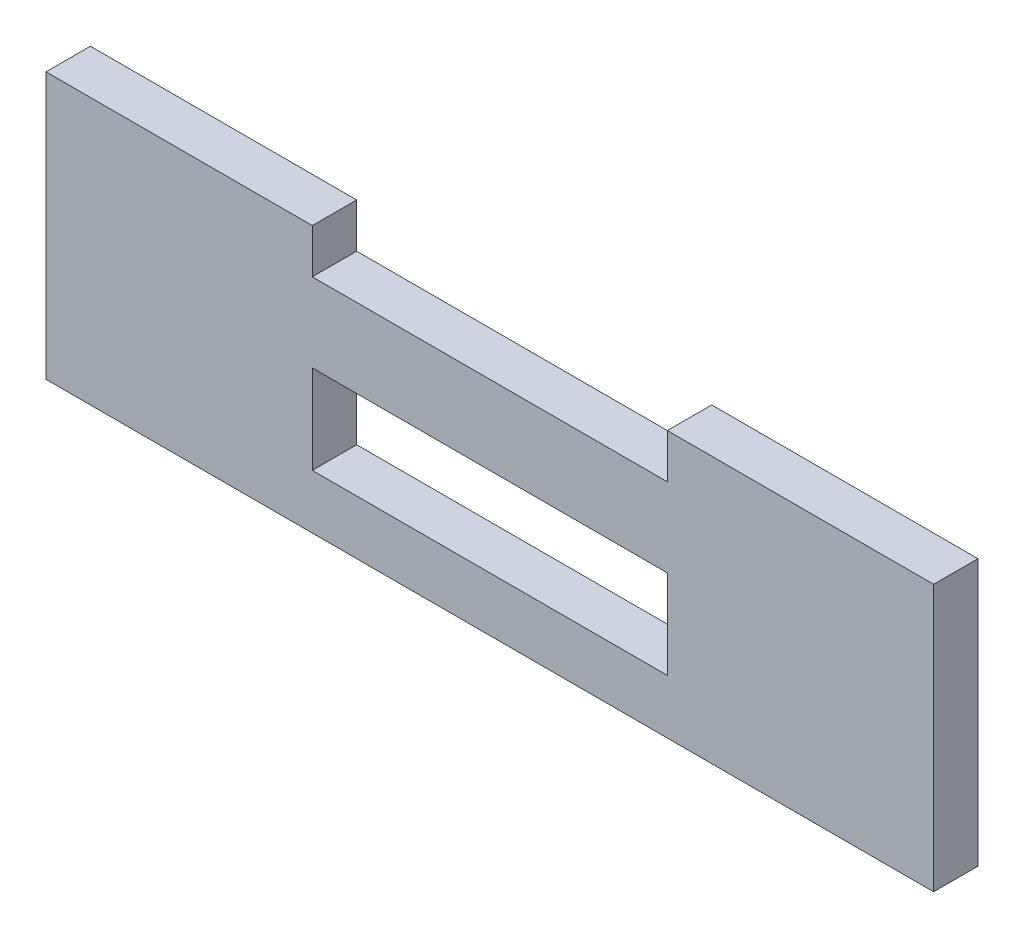
ISO-10303-21;
HEADER;
FILE_DESCRIPTION(('STEP AP214'),'2;1');
FILE_NAME('part.step','',(''),(''),'','','');
FILE_SCHEMA(('AUTOMOTIVE_DESIGN { 1 0 10303 214 1 1 1 1 }'));
ENDSEC;
DATA;
#1=APPLICATION_CONTEXT('core data for automotive mechanical design processes');
#2=APPLICATION_PROTOCOL_DEFINITION('international standard','automotive_design',2000,#1);
#3=PRODUCT_CONTEXT('',#1,'mechanical');
#4=PRODUCT('Part','Part','',(#3));
#5=PRODUCT_RELATED_PRODUCT_CATEGORY('part','',(#4));
#6=PRODUCT_DEFINITION_FORMATION('','',#4);
#7=PRODUCT_DEFINITION_CONTEXT('part definition',#1,'design');
#8=PRODUCT_DEFINITION('design','',#6,#7);
#9=PRODUCT_DEFINITION_SHAPE('','',#8);
#10=(LENGTH_UNIT() NAMED_UNIT(*) SI_UNIT(.MILLI.,.METRE.));
#11=(NAMED_UNIT(*) PLANE_ANGLE_UNIT() SI_UNIT($,.RADIAN.));
#12=(NAMED_UNIT(*) SI_UNIT($,.STERADIAN.) SOLID_ANGLE_UNIT());
#13=UNCERTAINTY_MEASURE_WITH_UNIT(LENGTH_MEASURE(1.E-05),#10,'distance_accuracy_value','');
#14=(GEOMETRIC_REPRESENTATION_CONTEXT(3) GLOBAL_UNCERTAINTY_ASSIGNED_CONTEXT((#13)) GLOBAL_UNIT_ASSIGNED_CONTEXT((#10,
#11,#12)) REPRESENTATION_CONTEXT('',''));
#15=CARTESIAN_POINT('',(0.,0.,0.));
#16=DIRECTION('',(0.,0.,1.));
#17=DIRECTION('',(1.,0.,0.));
#18=AXIS2_PLACEMENT_3D('',#15,#16,#17);
#19=CARTESIAN_POINT('',(20.,3.88549677867985,5.));
#20=DIRECTION('',(0.,-1.,0.));
#21=DIRECTION('',(1.,0.,0.));
#22=AXIS2_PLACEMENT_3D('',#19,#20,#21);
#23=PLANE('',#22);
#24=DIRECTION('',(-1.,0.,0.));
#25=VECTOR('',#24,1.);
#26=CARTESIAN_POINT('',(20.,3.88549677867985,0.));
#27=LINE('',#26,#25);
#28=CARTESIAN_POINT('',(50.,3.88549677867985,0.));
#29=VERTEX_POINT('',#28);
#30=CARTESIAN_POINT('',(20.,3.88549677867985,0.));
#31=VERTEX_POINT('',#30);
#32=EDGE_CURVE('E154',#29,#31,#27,.T.);
#33=ORIENTED_EDGE('',*,*,#32,.T.);
#34=DIRECTION('',(0.,0.,-1.));
#35=VECTOR('',#34,1.);
#36=CARTESIAN_POINT('',(20.,3.88549677867985,5.));
#37=LINE('',#36,#35);
#38=CARTESIAN_POINT('',(20.,3.88549677867985,5.));
#39=VERTEX_POINT('',#38);
#40=EDGE_CURVE('E11',#39,#31,#37,.T.);
#41=ORIENTED_EDGE('',*,*,#40,.F.);
#42=DIRECTION('',(-1.,0.,0.));
#43=VECTOR('',#42,1.);
#44=CARTESIAN_POINT('',(20.,3.88549677867985,5.));
#45=LINE('',#44,#43);
#46=CARTESIAN_POINT('',(50.,3.88549677867985,5.));
#47=VERTEX_POINT('',#46);
#48=EDGE_CURVE('E158',#47,#39,#45,.T.);
#49=ORIENTED_EDGE('',*,*,#48,.F.);
#50=DIRECTION('',(0.,0.,-1.));
#51=VECTOR('',#50,1.);
#52=CARTESIAN_POINT('',(50.,3.88549677867985,5.));
#53=LINE('',#52,#51);
#54=EDGE_CURVE('E176',#47,#29,#53,.T.);
#55=ORIENTED_EDGE('',*,*,#54,.T.);
#56=EDGE_LOOP('',(#33,#41,#49,#55));
#57=FACE_BOUND('',#56,.T.);
#58=ADVANCED_FACE('F33',(#57),#23,.F.);
#59=CARTESIAN_POINT('',(20.,-1.11450322132015,5.));
#60=DIRECTION('',(1.,0.,0.));
#61=DIRECTION('',(0.,0.,-1.));
#62=AXIS2_PLACEMENT_3D('',#59,#60,#61);
#63=PLANE('',#62);
#64=DIRECTION('',(0.,-1.,0.));
#65=VECTOR('',#64,1.);
#66=CARTESIAN_POINT('',(20.,-1.11450322132015,0.));
#67=LINE('',#66,#65);
#68=CARTESIAN_POINT('',(20.,-1.11450322132015,0.));
#69=VERTEX_POINT('',#68);
#70=EDGE_CURVE('E179',#31,#69,#67,.T.);
#71=ORIENTED_EDGE('',*,*,#70,.T.);
#72=DIRECTION('',(0.,0.,-1.));
#73=VECTOR('',#72,1.);
#74=CARTESIAN_POINT('',(20.,-1.11450322132015,5.));
#75=LINE('',#74,#73);
#76=CARTESIAN_POINT('',(20.,-1.11450322132015,5.));
#77=VERTEX_POINT('',#76);
#78=EDGE_CURVE('E40',#77,#69,#75,.T.);
#79=ORIENTED_EDGE('',*,*,#78,.F.);
#80=DIRECTION('',(0.,-1.,0.));
#81=VECTOR('',#80,1.);
#82=CARTESIAN_POINT('',(20.,-1.11450322132015,5.));
#83=LINE('',#82,#81);
#84=EDGE_CURVE('E161',#39,#77,#83,.T.);
#85=ORIENTED_EDGE('',*,*,#84,.F.);
#86=ORIENTED_EDGE('',*,*,#40,.T.);
#87=EDGE_LOOP('',(#71,#79,#85,#86));
#88=FACE_BOUND('',#87,.T.);
#89=ADVANCED_FACE('F234',(#88),#63,.F.);
#90=CARTESIAN_POINT('',(-20.,-1.11450322132015,5.));
#91=DIRECTION('',(0.,-1.,0.));
#92=DIRECTION('',(0.,0.,-1.));
#93=AXIS2_PLACEMENT_3D('',#90,#91,#92);
#94=PLANE('',#93);
#95=DIRECTION('',(-1.,0.,0.));
#96=VECTOR('',#95,1.);
#97=CARTESIAN_POINT('',(-20.,-1.11450322132015,0.));
#98=LINE('',#97,#96);
#99=CARTESIAN_POINT('',(-20.,-1.11450322132015,0.));
#100=VERTEX_POINT('',#99);
#101=EDGE_CURVE('E181',#69,#100,#98,.T.);
#102=ORIENTED_EDGE('',*,*,#101,.T.);
#103=DIRECTION('',(0.,0.,-1.));
#104=VECTOR('',#103,1.);
#105=CARTESIAN_POINT('',(-20.,-1.11450322132015,5.));
#106=LINE('',#105,#104);
#107=CARTESIAN_POINT('',(-20.,-1.11450322132015,5.));
#108=VERTEX_POINT('',#107);
#109=EDGE_CURVE('E206',#108,#100,#106,.T.);
#110=ORIENTED_EDGE('',*,*,#109,.F.);
#111=DIRECTION('',(-1.,0.,0.));
#112=VECTOR('',#111,1.);
#113=CARTESIAN_POINT('',(-20.,-1.11450322132015,5.));
#114=LINE('',#113,#112);
#115=EDGE_CURVE('E164',#77,#108,#114,.T.);
#116=ORIENTED_EDGE('',*,*,#115,.F.);
#117=ORIENTED_EDGE('',*,*,#78,.T.);
#118=EDGE_LOOP('',(#102,#110,#116,#117));
#119=FACE_BOUND('',#118,.T.);
#120=ADVANCED_FACE('F213',(#119),#94,.F.);
#121=CARTESIAN_POINT('',(-20.,3.88549677867985,5.));
#122=DIRECTION('',(-1.,0.,0.));
#123=DIRECTION('',(0.,0.,1.));
#124=AXIS2_PLACEMENT_3D('',#121,#122,#123);
#125=PLANE('',#124);
#126=DIRECTION('',(0.,1.,0.));
#127=VECTOR('',#126,1.);
#128=CARTESIAN_POINT('',(-20.,3.88549677867985,0.));
#129=LINE('',#128,#127);
#130=CARTESIAN_POINT('',(-20.,3.88549677867985,0.));
#131=VERTEX_POINT('',#130);
#132=EDGE_CURVE('E183',#100,#131,#129,.T.);
#133=ORIENTED_EDGE('',*,*,#132,.T.);
#134=DIRECTION('',(0.,0.,-1.));
#135=VECTOR('',#134,1.);
#136=CARTESIAN_POINT('',(-20.,3.88549677867985,5.));
#137=LINE('',#136,#135);
#138=CARTESIAN_POINT('',(-20.,3.88549677867985,5.));
#139=VERTEX_POINT('',#138);
#140=EDGE_CURVE('E203',#139,#131,#137,.T.);
#141=ORIENTED_EDGE('',*,*,#140,.F.);
#142=DIRECTION('',(0.,1.,0.));
#143=VECTOR('',#142,1.);
#144=CARTESIAN_POINT('',(-20.,3.88549677867985,5.));
#145=LINE('',#144,#143);
#146=EDGE_CURVE('E166',#108,#139,#145,.T.);
#147=ORIENTED_EDGE('',*,*,#146,.F.);
#148=ORIENTED_EDGE('',*,*,#109,.T.);
#149=EDGE_LOOP('',(#133,#141,#147,#148));
#150=FACE_BOUND('',#149,.T.);
#151=ADVANCED_FACE('F222',(#150),#125,.F.);
#152=CARTESIAN_POINT('',(-50.,3.88549677867985,5.));
#153=DIRECTION('',(0.,-1.,0.));
#154=DIRECTION('',(1.,0.,0.));
#155=AXIS2_PLACEMENT_3D('',#152,#153,#154);
#156=PLANE('',#155);
#157=DIRECTION('',(-1.,0.,0.));
#158=VECTOR('',#157,1.);
#159=CARTESIAN_POINT('',(-50.,3.88549677867985,0.));
#160=LINE('',#159,#158);
#161=CARTESIAN_POINT('',(-50.,3.88549677867985,0.));
#162=VERTEX_POINT('',#161);
#163=EDGE_CURVE('E185',#131,#162,#160,.T.);
#164=ORIENTED_EDGE('',*,*,#163,.T.);
#165=DIRECTION('',(0.,0.,-1.));
#166=VECTOR('',#165,1.);
#167=CARTESIAN_POINT('',(-50.,3.88549677867985,5.));
#168=LINE('',#167,#166);
#169=CARTESIAN_POINT('',(-50.,3.88549677867985,5.));
#170=VERTEX_POINT('',#169);
#171=EDGE_CURVE('E200',#170,#162,#168,.T.);
#172=ORIENTED_EDGE('',*,*,#171,.F.);
#173=DIRECTION('',(-1.,0.,0.));
#174=VECTOR('',#173,1.);
#175=CARTESIAN_POINT('',(-50.,3.88549677867985,5.));
#176=LINE('',#175,#174);
#177=EDGE_CURVE('E168',#139,#170,#176,.T.);
#178=ORIENTED_EDGE('',*,*,#177,.F.);
#179=ORIENTED_EDGE('',*,*,#140,.T.);
#180=EDGE_LOOP('',(#164,#172,#178,#179));
#181=FACE_BOUND('',#180,.T.);
#182=ADVANCED_FACE('F226',(#181),#156,.F.);
#183=CARTESIAN_POINT('',(-50.,-26.1145032213201,5.));
#184=DIRECTION('',(1.,0.,0.));
#185=DIRECTION('',(0.,0.,-1.));
#186=AXIS2_PLACEMENT_3D('',#183,#184,#185);
#187=PLANE('',#186);
#188=DIRECTION('',(0.,-1.,0.));
#189=VECTOR('',#188,1.);
#190=CARTESIAN_POINT('',(-50.,-26.1145032213201,0.));
#191=LINE('',#190,#189);
#192=CARTESIAN_POINT('',(-50.,-26.1145032213201,0.));
#193=VERTEX_POINT('',#192);
#194=EDGE_CURVE('E187',#162,#193,#191,.T.);
#195=ORIENTED_EDGE('',*,*,#194,.T.);
#196=DIRECTION('',(0.,0.,-1.));
#197=VECTOR('',#196,1.);
#198=CARTESIAN_POINT('',(-50.,-26.1145032213201,5.));
#199=LINE('',#198,#197);
#200=CARTESIAN_POINT('',(-50.,-26.1145032213201,5.));
#201=VERTEX_POINT('',#200);
#202=EDGE_CURVE('E197',#201,#193,#199,.T.);
#203=ORIENTED_EDGE('',*,*,#202,.F.);
#204=DIRECTION('',(0.,-1.,0.));
#205=VECTOR('',#204,1.);
#206=CARTESIAN_POINT('',(-50.,-26.1145032213201,5.));
#207=LINE('',#206,#205);
#208=EDGE_CURVE('E170',#170,#201,#207,.T.);
#209=ORIENTED_EDGE('',*,*,#208,.F.);
#210=ORIENTED_EDGE('',*,*,#171,.T.);
#211=EDGE_LOOP('',(#195,#203,#209,#210));
#212=FACE_BOUND('',#211,.T.);
#213=ADVANCED_FACE('F247',(#212),#187,.F.);
#214=CARTESIAN_POINT('',(-50.,-26.1145032213201,5.));
#215=DIRECTION('',(0.,1.,0.));
#216=DIRECTION('',(0.,0.,1.));
#217=AXIS2_PLACEMENT_3D('',#214,#215,#216);
#218=PLANE('',#217);
#219=DIRECTION('',(1.,0.,0.));
#220=VECTOR('',#219,1.);
#221=CARTESIAN_POINT('',(-50.,-26.1145032213201,0.));
#222=LINE('',#221,#220);
#223=CARTESIAN_POINT('',(50.,-26.1145032213201,0.));
#224=VERTEX_POINT('',#223);
#225=EDGE_CURVE('E189',#193,#224,#222,.T.);
#226=ORIENTED_EDGE('',*,*,#225,.T.);
#227=DIRECTION('',(0.,0.,-1.));
#228=VECTOR('',#227,1.);
#229=CARTESIAN_POINT('',(50.,-26.1145032213201,5.));
#230=LINE('',#229,#228);
#231=CARTESIAN_POINT('',(50.,-26.1145032213201,5.));
#232=VERTEX_POINT('',#231);
#233=EDGE_CURVE('E194',#232,#224,#230,.T.);
#234=ORIENTED_EDGE('',*,*,#233,.F.);
#235=DIRECTION('',(1.,0.,0.));
#236=VECTOR('',#235,1.);
#237=CARTESIAN_POINT('',(-50.,-26.1145032213201,5.));
#238=LINE('',#237,#236);
#239=EDGE_CURVE('E172',#201,#232,#238,.T.);
#240=ORIENTED_EDGE('',*,*,#239,.F.);
#241=ORIENTED_EDGE('',*,*,#202,.T.);
#242=EDGE_LOOP('',(#226,#234,#240,#241));
#243=FACE_BOUND('',#242,.T.);
#244=ADVANCED_FACE('F245',(#243),#218,.F.);
#245=CARTESIAN_POINT('',(50.,-26.1145032213201,5.));
#246=DIRECTION('',(-1.,0.,0.));
#247=DIRECTION('',(0.,0.,1.));
#248=AXIS2_PLACEMENT_3D('',#245,#246,#247);
#249=PLANE('',#248);
#250=DIRECTION('',(0.,1.,0.));
#251=VECTOR('',#250,1.);
#252=CARTESIAN_POINT('',(50.,-26.1145032213201,0.));
#253=LINE('',#252,#251);
#254=EDGE_CURVE('E162',#224,#29,#253,.T.);
#255=ORIENTED_EDGE('',*,*,#254,.T.);
#256=ORIENTED_EDGE('',*,*,#54,.F.);
#257=DIRECTION('',(0.,1.,0.));
#258=VECTOR('',#257,1.);
#259=CARTESIAN_POINT('',(50.,-26.1145032213201,5.));
#260=LINE('',#259,#258);
#261=EDGE_CURVE('E174',#232,#47,#260,.T.);
#262=ORIENTED_EDGE('',*,*,#261,.F.);
#263=ORIENTED_EDGE('',*,*,#233,.T.);
#264=EDGE_LOOP('',(#255,#256,#262,#263));
#265=FACE_BOUND('',#264,.T.);
#266=ADVANCED_FACE('F240',(#265),#249,.F.);
#267=CARTESIAN_POINT('',(0.,0.,5.));
#268=DIRECTION('',(0.,0.,1.));
#269=DIRECTION('',(1.,0.,0.));
#270=AXIS2_PLACEMENT_3D('',#267,#268,#269);
#271=PLANE('',#270);
#272=DIRECTION('',(0.,-1.,0.));
#273=VECTOR('',#272,1.);
#274=CARTESIAN_POINT('',(-20.,-10.,5.));
#275=LINE('',#274,#273);
#276=CARTESIAN_POINT('',(-20.,-10.,5.));
#277=VERTEX_POINT('',#276);
#278=CARTESIAN_POINT('',(-20.,-20.,5.));
#279=VERTEX_POINT('',#278);
#280=EDGE_CURVE('E47',#277,#279,#275,.T.);
#281=ORIENTED_EDGE('',*,*,#280,.F.);
#282=DIRECTION('',(-1.,0.,0.));
#283=VECTOR('',#282,1.);
#284=CARTESIAN_POINT('',(-20.,-10.,5.));
#285=LINE('',#284,#283);
#286=CARTESIAN_POINT('',(20.,-9.99999999999999,5.));
#287=VERTEX_POINT('',#286);
#288=EDGE_CURVE('E139',#287,#277,#285,.T.);
#289=ORIENTED_EDGE('',*,*,#288,.F.);
#290=DIRECTION('',(0.,1.,0.));
#291=VECTOR('',#290,1.);
#292=CARTESIAN_POINT('',(20.,-9.99999999999999,5.));
#293=LINE('',#292,#291);
#294=CARTESIAN_POINT('',(20.,-20.,5.));
#295=VERTEX_POINT('',#294);
#296=EDGE_CURVE('E142',#295,#287,#293,.T.);
#297=ORIENTED_EDGE('',*,*,#296,.F.);
#298=DIRECTION('',(1.,0.,0.));
#299=VECTOR('',#298,1.);
#300=CARTESIAN_POINT('',(-20.,-20.,5.));
#301=LINE('',#300,#299);
#302=EDGE_CURVE('E148',#279,#295,#301,.T.);
#303=ORIENTED_EDGE('',*,*,#302,.F.);
#304=EDGE_LOOP('',(#281,#289,#297,#303));
#305=FACE_BOUND('',#304,.T.);
#306=ORIENTED_EDGE('',*,*,#48,.T.);
#307=ORIENTED_EDGE('',*,*,#84,.T.);
#308=ORIENTED_EDGE('',*,*,#115,.T.);
#309=ORIENTED_EDGE('',*,*,#146,.T.);
#310=ORIENTED_EDGE('',*,*,#177,.T.);
#311=ORIENTED_EDGE('',*,*,#208,.T.);
#312=ORIENTED_EDGE('',*,*,#239,.T.);
#313=ORIENTED_EDGE('',*,*,#261,.T.);
#314=EDGE_LOOP('',(#306,#307,#308,#309,#310,#311,#312,#313));
#315=FACE_BOUND('',#314,.T.);
#316=ADVANCED_FACE('F230',(#305,#315),#271,.T.);
#317=CARTESIAN_POINT('',(0.,0.,0.));
#318=DIRECTION('',(0.,0.,1.));
#319=DIRECTION('',(1.,0.,0.));
#320=AXIS2_PLACEMENT_3D('',#317,#318,#319);
#321=PLANE('',#320);
#322=DIRECTION('',(-1.,0.,0.));
#323=VECTOR('',#322,1.);
#324=CARTESIAN_POINT('',(-20.,-10.,0.));
#325=LINE('',#324,#323);
#326=CARTESIAN_POINT('',(20.,-9.99999999999999,0.));
#327=VERTEX_POINT('',#326);
#328=CARTESIAN_POINT('',(-20.,-10.,0.));
#329=VERTEX_POINT('',#328);
#330=EDGE_CURVE('E129',#327,#329,#325,.T.);
#331=ORIENTED_EDGE('',*,*,#330,.T.);
#332=DIRECTION('',(0.,-1.,0.));
#333=VECTOR('',#332,1.);
#334=CARTESIAN_POINT('',(-20.,-10.,0.));
#335=LINE('',#334,#333);
#336=CARTESIAN_POINT('',(-20.,-20.,0.));
#337=VERTEX_POINT('',#336);
#338=EDGE_CURVE('E123',#329,#337,#335,.T.);
#339=ORIENTED_EDGE('',*,*,#338,.T.);
#340=DIRECTION('',(1.,0.,0.));
#341=VECTOR('',#340,1.);
#342=CARTESIAN_POINT('',(-20.,-20.,0.));
#343=LINE('',#342,#341);
#344=CARTESIAN_POINT('',(20.,-20.,0.));
#345=VERTEX_POINT('',#344);
#346=EDGE_CURVE('E132',#337,#345,#343,.T.);
#347=ORIENTED_EDGE('',*,*,#346,.T.);
#348=DIRECTION('',(0.,1.,0.));
#349=VECTOR('',#348,1.);
#350=CARTESIAN_POINT('',(20.,-9.99999999999999,0.));
#351=LINE('',#350,#349);
#352=EDGE_CURVE('E55',#345,#327,#351,.T.);
#353=ORIENTED_EDGE('',*,*,#352,.T.);
#354=EDGE_LOOP('',(#331,#339,#347,#353));
#355=FACE_BOUND('',#354,.T.);
#356=ORIENTED_EDGE('',*,*,#32,.F.);
#357=ORIENTED_EDGE('',*,*,#254,.F.);
#358=ORIENTED_EDGE('',*,*,#225,.F.);
#359=ORIENTED_EDGE('',*,*,#194,.F.);
#360=ORIENTED_EDGE('',*,*,#163,.F.);
#361=ORIENTED_EDGE('',*,*,#132,.F.);
#362=ORIENTED_EDGE('',*,*,#101,.F.);
#363=ORIENTED_EDGE('',*,*,#70,.F.);
#364=EDGE_LOOP('',(#356,#357,#358,#359,#360,#361,#362,#363));
#365=FACE_BOUND('',#364,.T.);
#366=ADVANCED_FACE('F136',(#355,#365),#321,.F.);
#367=CARTESIAN_POINT('',(-20.,-10.,0.));
#368=DIRECTION('',(-1.,0.,0.));
#369=DIRECTION('',(0.,0.,1.));
#370=AXIS2_PLACEMENT_3D('',#367,#368,#369);
#371=PLANE('',#370);
#372=ORIENTED_EDGE('',*,*,#280,.T.);
#373=DIRECTION('',(0.,0.,1.));
#374=VECTOR('',#373,1.);
#375=CARTESIAN_POINT('',(-20.,-20.,0.));
#376=LINE('',#375,#374);
#377=EDGE_CURVE('E119',#337,#279,#376,.T.);
#378=ORIENTED_EDGE('',*,*,#377,.F.);
#379=ORIENTED_EDGE('',*,*,#338,.F.);
#380=DIRECTION('',(0.,0.,1.));
#381=VECTOR('',#380,1.);
#382=CARTESIAN_POINT('',(-20.,-10.,0.));
#383=LINE('',#382,#381);
#384=EDGE_CURVE('E152',#329,#277,#383,.T.);
#385=ORIENTED_EDGE('',*,*,#384,.T.);
#386=EDGE_LOOP('',(#372,#378,#379,#385));
#387=FACE_BOUND('',#386,.T.);
#388=ADVANCED_FACE('F121',(#387),#371,.F.);
#389=CARTESIAN_POINT('',(-20.,-10.,0.));
#390=DIRECTION('',(0.,1.,0.));
#391=DIRECTION('',(-1.,0.,0.));
#392=AXIS2_PLACEMENT_3D('',#389,#390,#391);
#393=PLANE('',#392);
#394=ORIENTED_EDGE('',*,*,#288,.T.);
#395=ORIENTED_EDGE('',*,*,#384,.F.);
#396=ORIENTED_EDGE('',*,*,#330,.F.);
#397=DIRECTION('',(0.,0.,1.));
#398=VECTOR('',#397,1.);
#399=CARTESIAN_POINT('',(20.,-9.99999999999999,0.));
#400=LINE('',#399,#398);
#401=EDGE_CURVE('E155',#327,#287,#400,.T.);
#402=ORIENTED_EDGE('',*,*,#401,.T.);
#403=EDGE_LOOP('',(#394,#395,#396,#402));
#404=FACE_BOUND('',#403,.T.);
#405=ADVANCED_FACE('F314',(#404),#393,.F.);
#406=CARTESIAN_POINT('',(20.,-9.99999999999999,0.));
#407=DIRECTION('',(1.,0.,0.));
#408=DIRECTION('',(0.,0.,-1.));
#409=AXIS2_PLACEMENT_3D('',#406,#407,#408);
#410=PLANE('',#409);
#411=ORIENTED_EDGE('',*,*,#296,.T.);
#412=ORIENTED_EDGE('',*,*,#401,.F.);
#413=ORIENTED_EDGE('',*,*,#352,.F.);
#414=DIRECTION('',(0.,0.,1.));
#415=VECTOR('',#414,1.);
#416=CARTESIAN_POINT('',(20.,-20.,0.));
#417=LINE('',#416,#415);
#418=EDGE_CURVE('E128',#345,#295,#417,.T.);
#419=ORIENTED_EDGE('',*,*,#418,.T.);
#420=EDGE_LOOP('',(#411,#412,#413,#419));
#421=FACE_BOUND('',#420,.T.);
#422=ADVANCED_FACE('F323',(#421),#410,.F.);
#423=CARTESIAN_POINT('',(-20.,-20.,0.));
#424=DIRECTION('',(0.,-1.,0.));
#425=DIRECTION('',(1.,0.,0.));
#426=AXIS2_PLACEMENT_3D('',#423,#424,#425);
#427=PLANE('',#426);
#428=ORIENTED_EDGE('',*,*,#302,.T.);
#429=ORIENTED_EDGE('',*,*,#418,.F.);
#430=ORIENTED_EDGE('',*,*,#346,.F.);
#431=ORIENTED_EDGE('',*,*,#377,.T.);
#432=EDGE_LOOP('',(#428,#429,#430,#431));
#433=FACE_BOUND('',#432,.T.);
#434=ADVANCED_FACE('F133',(#433),#427,.F.);
#435=CLOSED_SHELL('',(#58,#89,#120,#151,#182,#213,#244,#266,#316,#366,#388,#405,#422,#434));
#436=MANIFOLD_SOLID_BREP('B2',#435);
#437=ADVANCED_BREP_SHAPE_REPRESENTATION('',(#18,#436),#14);
#438=SHAPE_DEFINITION_REPRESENTATION(#9,#437);
ENDSEC;
END-ISO-10303-21;
